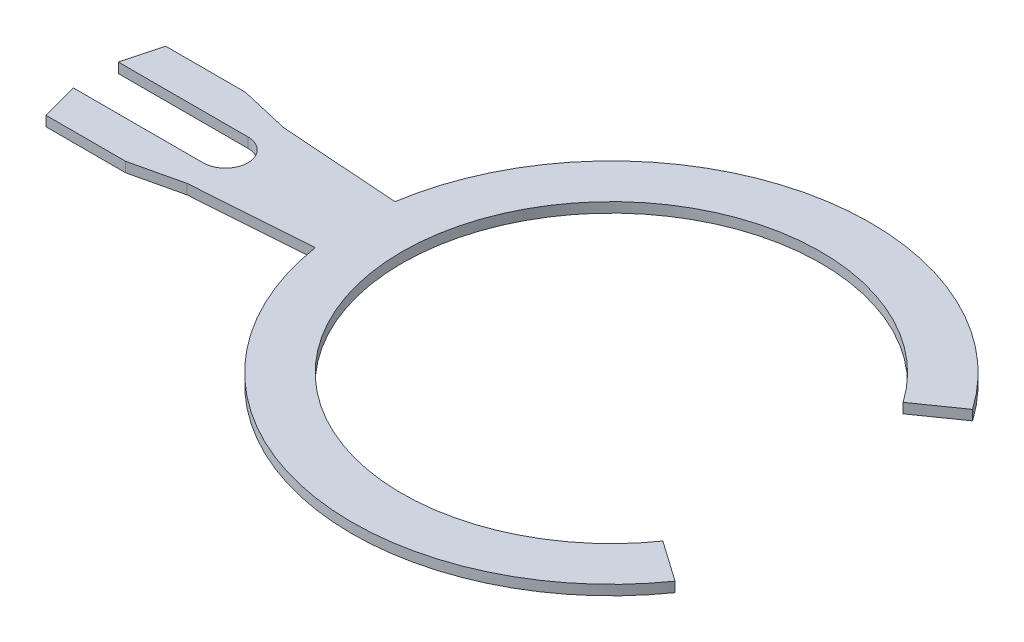
ISO-10303-21;
HEADER;
FILE_DESCRIPTION(('STEP AP214'),'2;1');
FILE_NAME('part.step','',(''),(''),'','','');
FILE_SCHEMA(('AUTOMOTIVE_DESIGN { 1 0 10303 214 1 1 1 1 }'));
ENDSEC;
DATA;
#1=APPLICATION_CONTEXT('core data for automotive mechanical design processes');
#2=APPLICATION_PROTOCOL_DEFINITION('international standard','automotive_design',2000,#1);
#3=PRODUCT_CONTEXT('',#1,'mechanical');
#4=PRODUCT('Part','Part','',(#3));
#5=PRODUCT_RELATED_PRODUCT_CATEGORY('part','',(#4));
#6=PRODUCT_DEFINITION_FORMATION('','',#4);
#7=PRODUCT_DEFINITION_CONTEXT('part definition',#1,'design');
#8=PRODUCT_DEFINITION('design','',#6,#7);
#9=PRODUCT_DEFINITION_SHAPE('','',#8);
#10=(LENGTH_UNIT() NAMED_UNIT(*) SI_UNIT(.MILLI.,.METRE.));
#11=(NAMED_UNIT(*) PLANE_ANGLE_UNIT() SI_UNIT($,.RADIAN.));
#12=(NAMED_UNIT(*) SI_UNIT($,.STERADIAN.) SOLID_ANGLE_UNIT());
#13=UNCERTAINTY_MEASURE_WITH_UNIT(LENGTH_MEASURE(1.E-05),#10,'distance_accuracy_value','');
#14=(GEOMETRIC_REPRESENTATION_CONTEXT(3) GLOBAL_UNCERTAINTY_ASSIGNED_CONTEXT((#13)) GLOBAL_UNIT_ASSIGNED_CONTEXT((#10,
#11,#12)) REPRESENTATION_CONTEXT('',''));
#15=CARTESIAN_POINT('',(0.,0.,0.));
#16=DIRECTION('',(0.,0.,1.));
#17=DIRECTION('',(1.,0.,0.));
#18=AXIS2_PLACEMENT_3D('',#15,#16,#17);
#19=CARTESIAN_POINT('',(0.,-0.1,0.));
#20=DIRECTION('',(0.,-1.,0.));
#21=DIRECTION('',(0.,0.,-1.));
#22=AXIS2_PLACEMENT_3D('',#19,#20,#21);
#23=CYLINDRICAL_SURFACE('',#22,2.1);
#24=CARTESIAN_POINT('',(0.,-0.2,0.));
#25=DIRECTION('',(0.,1.,0.));
#26=DIRECTION('',(0.,0.,1.));
#27=AXIS2_PLACEMENT_3D('',#24,#25,#26);
#28=CIRCLE('',#27,2.1);
#29=CARTESIAN_POINT('',(1.72021929300688,-0.2,-1.2045105163372));
#30=VERTEX_POINT('',#29);
#31=CARTESIAN_POINT('',(1.72021929300688,-0.2,1.2045105163372));
#32=VERTEX_POINT('',#31);
#33=EDGE_CURVE('E179',#30,#32,#28,.T.);
#34=ORIENTED_EDGE('',*,*,#33,.F.);
#35=DIRECTION('',(0.,-1.,0.));
#36=VECTOR('',#35,1.);
#37=CARTESIAN_POINT('',(1.72021929300688,-0.1,-1.2045105163372));
#38=LINE('',#37,#36);
#39=CARTESIAN_POINT('',(1.72021929300688,-0.1,-1.2045105163372));
#40=VERTEX_POINT('',#39);
#41=EDGE_CURVE('E11',#40,#30,#38,.T.);
#42=ORIENTED_EDGE('',*,*,#41,.F.);
#43=CARTESIAN_POINT('',(0.,-0.1,0.));
#44=DIRECTION('',(0.,1.,0.));
#45=DIRECTION('',(0.,0.,1.));
#46=AXIS2_PLACEMENT_3D('',#43,#44,#45);
#47=CIRCLE('',#46,2.1);
#48=CARTESIAN_POINT('',(1.72021929300688,-0.1,1.2045105163372));
#49=VERTEX_POINT('',#48);
#50=EDGE_CURVE('E223',#40,#49,#47,.T.);
#51=ORIENTED_EDGE('',*,*,#50,.T.);
#52=DIRECTION('',(0.,-1.,0.));
#53=VECTOR('',#52,1.);
#54=CARTESIAN_POINT('',(1.72021929300688,-0.1,1.2045105163372));
#55=LINE('',#54,#53);
#56=EDGE_CURVE('E37',#49,#32,#55,.T.);
#57=ORIENTED_EDGE('',*,*,#56,.T.);
#58=EDGE_LOOP('',(#34,#42,#51,#57));
#59=FACE_BOUND('',#58,.T.);
#60=ADVANCED_FACE('F34',(#59),#23,.F.);
#61=CARTESIAN_POINT('',(2.12979531515138,-0.1,-1.49129873451272));
#62=DIRECTION('',(0.573576436351048,0.,0.819152044288991));
#63=DIRECTION('',(0.819152044288991,0.,-0.573576436351048));
#64=AXIS2_PLACEMENT_3D('',#61,#62,#63);
#65=PLANE('',#64);
#66=DIRECTION('',(-0.819152044288991,0.,0.573576436351048));
#67=VECTOR('',#66,1.);
#68=CARTESIAN_POINT('',(2.12979531515138,-0.2,-1.49129873451272));
#69=LINE('',#68,#67);
#70=CARTESIAN_POINT('',(2.12979531515138,-0.2,-1.49129873451272));
#71=VERTEX_POINT('',#70);
#72=EDGE_CURVE('E221',#71,#30,#69,.T.);
#73=ORIENTED_EDGE('',*,*,#72,.F.);
#74=DIRECTION('',(0.,-1.,0.));
#75=VECTOR('',#74,1.);
#76=CARTESIAN_POINT('',(2.12979531515138,-0.1,-1.49129873451272));
#77=LINE('',#76,#75);
#78=CARTESIAN_POINT('',(2.12979531515138,-0.1,-1.49129873451272));
#79=VERTEX_POINT('',#78);
#80=EDGE_CURVE('E43',#79,#71,#77,.T.);
#81=ORIENTED_EDGE('',*,*,#80,.F.);
#82=DIRECTION('',(-0.819152044288991,0.,0.573576436351048));
#83=VECTOR('',#82,1.);
#84=CARTESIAN_POINT('',(2.12979531515138,-0.1,-1.49129873451272));
#85=LINE('',#84,#83);
#86=EDGE_CURVE('E169',#79,#40,#85,.T.);
#87=ORIENTED_EDGE('',*,*,#86,.T.);
#88=ORIENTED_EDGE('',*,*,#41,.T.);
#89=EDGE_LOOP('',(#73,#81,#87,#88));
#90=FACE_BOUND('',#89,.T.);
#91=ADVANCED_FACE('F251',(#90),#65,.T.);
#92=CARTESIAN_POINT('',(0.,-0.1,0.));
#93=DIRECTION('',(0.,-1.,0.));
#94=DIRECTION('',(0.,0.,-1.));
#95=AXIS2_PLACEMENT_3D('',#92,#93,#94);
#96=CYLINDRICAL_SURFACE('',#95,2.6);
#97=CARTESIAN_POINT('',(0.,-0.2,0.));
#98=DIRECTION('',(0.,-1.,0.));
#99=DIRECTION('',(0.,0.,-1.));
#100=AXIS2_PLACEMENT_3D('',#97,#98,#99);
#101=CIRCLE('',#100,2.6);
#102=CARTESIAN_POINT('',(-2.56904651573302,-0.2,-0.4));
#103=VERTEX_POINT('',#102);
#104=EDGE_CURVE('E156',#103,#71,#101,.T.);
#105=ORIENTED_EDGE('',*,*,#104,.F.);
#106=DIRECTION('',(0.,-1.,0.));
#107=VECTOR('',#106,1.);
#108=CARTESIAN_POINT('',(-2.56904651573302,-0.1,-0.4));
#109=LINE('',#108,#107);
#110=CARTESIAN_POINT('',(-2.56904651573302,-0.1,-0.4));
#111=VERTEX_POINT('',#110);
#112=EDGE_CURVE('E151',#111,#103,#109,.T.);
#113=ORIENTED_EDGE('',*,*,#112,.F.);
#114=CARTESIAN_POINT('',(0.,-0.1,0.));
#115=DIRECTION('',(0.,-1.,0.));
#116=DIRECTION('',(0.,0.,-1.));
#117=AXIS2_PLACEMENT_3D('',#114,#115,#116);
#118=CIRCLE('',#117,2.6);
#119=EDGE_CURVE('E154',#111,#79,#118,.T.);
#120=ORIENTED_EDGE('',*,*,#119,.T.);
#121=ORIENTED_EDGE('',*,*,#80,.T.);
#122=EDGE_LOOP('',(#105,#113,#120,#121));
#123=FACE_BOUND('',#122,.T.);
#124=ADVANCED_FACE('F153',(#123),#96,.T.);
#125=CARTESIAN_POINT('',(-3.76904651573302,-0.1,-0.483912174332216));
#126=DIRECTION('',(0.0697564737441285,0.,-0.997564050259824));
#127=DIRECTION('',(-0.997564050259824,0.,-0.0697564737441285));
#128=AXIS2_PLACEMENT_3D('',#125,#126,#127);
#129=PLANE('',#128);
#130=DIRECTION('',(0.997564050259824,0.,0.0697564737441285));
#131=VECTOR('',#130,1.);
#132=CARTESIAN_POINT('',(-3.76904651573302,-0.2,-0.483912174332216));
#133=LINE('',#132,#131);
#134=CARTESIAN_POINT('',(-3.76904651573302,-0.2,-0.483912174332216));
#135=VERTEX_POINT('',#134);
#136=EDGE_CURVE('E218',#135,#103,#133,.T.);
#137=ORIENTED_EDGE('',*,*,#136,.F.);
#138=DIRECTION('',(0.,-1.,0.));
#139=VECTOR('',#138,1.);
#140=CARTESIAN_POINT('',(-3.76904651573302,-0.1,-0.483912174332216));
#141=LINE('',#140,#139);
#142=CARTESIAN_POINT('',(-3.76904651573302,-0.1,-0.483912174332216));
#143=VERTEX_POINT('',#142);
#144=EDGE_CURVE('E161',#143,#135,#141,.T.);
#145=ORIENTED_EDGE('',*,*,#144,.F.);
#146=DIRECTION('',(0.997564050259824,0.,0.0697564737441285));
#147=VECTOR('',#146,1.);
#148=CARTESIAN_POINT('',(-3.76904651573302,-0.1,-0.483912174332216));
#149=LINE('',#148,#147);
#150=EDGE_CURVE('E167',#143,#111,#149,.T.);
#151=ORIENTED_EDGE('',*,*,#150,.T.);
#152=ORIENTED_EDGE('',*,*,#112,.T.);
#153=EDGE_LOOP('',(#137,#145,#151,#152));
#154=FACE_BOUND('',#153,.T.);
#155=ADVANCED_FACE('F171',(#154),#129,.T.);
#156=CARTESIAN_POINT('',(-4.26904651573302,-0.1,-0.599999999999999));
#157=DIRECTION('',(0.226160018119726,0.,-0.974090163282684));
#158=DIRECTION('',(-0.974090163282684,0.,-0.226160018119726));
#159=AXIS2_PLACEMENT_3D('',#156,#157,#158);
#160=PLANE('',#159);
#161=DIRECTION('',(0.974090163282684,0.,0.226160018119726));
#162=VECTOR('',#161,1.);
#163=CARTESIAN_POINT('',(-4.26904651573302,-0.2,-0.599999999999999));
#164=LINE('',#163,#162);
#165=CARTESIAN_POINT('',(-4.26904651573302,-0.2,-0.599999999999999));
#166=VERTEX_POINT('',#165);
#167=EDGE_CURVE('E215',#166,#135,#164,.T.);
#168=ORIENTED_EDGE('',*,*,#167,.F.);
#169=DIRECTION('',(0.,-1.,0.));
#170=VECTOR('',#169,1.);
#171=CARTESIAN_POINT('',(-4.26904651573302,-0.1,-0.599999999999999));
#172=LINE('',#171,#170);
#173=CARTESIAN_POINT('',(-4.26904651573302,-0.1,-0.599999999999999));
#174=VERTEX_POINT('',#173);
#175=EDGE_CURVE('E227',#174,#166,#172,.T.);
#176=ORIENTED_EDGE('',*,*,#175,.F.);
#177=DIRECTION('',(0.974090163282684,0.,0.226160018119726));
#178=VECTOR('',#177,1.);
#179=CARTESIAN_POINT('',(-4.26904651573302,-0.1,-0.599999999999999));
#180=LINE('',#179,#178);
#181=EDGE_CURVE('E172',#174,#143,#180,.T.);
#182=ORIENTED_EDGE('',*,*,#181,.T.);
#183=ORIENTED_EDGE('',*,*,#144,.T.);
#184=EDGE_LOOP('',(#168,#176,#182,#183));
#185=FACE_BOUND('',#184,.T.);
#186=ADVANCED_FACE('F264',(#185),#160,.T.);
#187=CARTESIAN_POINT('',(-5.06856556857135,-0.1,-0.599999999999999));
#188=DIRECTION('',(0.,0.,-1.));
#189=DIRECTION('',(-1.,0.,0.));
#190=AXIS2_PLACEMENT_3D('',#187,#188,#189);
#191=PLANE('',#190);
#192=DIRECTION('',(1.,0.,0.));
#193=VECTOR('',#192,1.);
#194=CARTESIAN_POINT('',(-5.06856556857135,-0.2,-0.599999999999999));
#195=LINE('',#194,#193);
#196=CARTESIAN_POINT('',(-5.06856556857135,-0.2,-0.599999999999999));
#197=VERTEX_POINT('',#196);
#198=EDGE_CURVE('E212',#197,#166,#195,.T.);
#199=ORIENTED_EDGE('',*,*,#198,.F.);
#200=DIRECTION('',(0.,-1.,0.));
#201=VECTOR('',#200,1.);
#202=CARTESIAN_POINT('',(-5.06856556857135,-0.1,-0.599999999999999));
#203=LINE('',#202,#201);
#204=CARTESIAN_POINT('',(-5.06856556857135,-0.1,-0.599999999999999));
#205=VERTEX_POINT('',#204);
#206=EDGE_CURVE('E229',#205,#197,#203,.T.);
#207=ORIENTED_EDGE('',*,*,#206,.F.);
#208=DIRECTION('',(1.,0.,0.));
#209=VECTOR('',#208,1.);
#210=CARTESIAN_POINT('',(-5.06856556857135,-0.1,-0.599999999999999));
#211=LINE('',#210,#209);
#212=EDGE_CURVE('E174',#205,#174,#211,.T.);
#213=ORIENTED_EDGE('',*,*,#212,.T.);
#214=ORIENTED_EDGE('',*,*,#175,.T.);
#215=EDGE_LOOP('',(#199,#207,#213,#214));
#216=FACE_BOUND('',#215,.T.);
#217=ADVANCED_FACE('F267',(#216),#191,.T.);
#218=CARTESIAN_POINT('',(-5.16904651573302,-0.1,-0.224999999999999));
#219=DIRECTION('',(-0.965925826289067,0.,-0.258819045102525));
#220=DIRECTION('',(-0.258819045102525,0.,0.965925826289067));
#221=AXIS2_PLACEMENT_3D('',#218,#219,#220);
#222=PLANE('',#221);
#223=DIRECTION('',(0.258819045102525,0.,-0.965925826289067));
#224=VECTOR('',#223,1.);
#225=CARTESIAN_POINT('',(-5.16904651573302,-0.2,-0.224999999999999));
#226=LINE('',#225,#224);
#227=CARTESIAN_POINT('',(-5.16904651573302,-0.2,-0.224999999999999));
#228=VERTEX_POINT('',#227);
#229=EDGE_CURVE('E209',#228,#197,#226,.T.);
#230=ORIENTED_EDGE('',*,*,#229,.F.);
#231=DIRECTION('',(0.,-1.,0.));
#232=VECTOR('',#231,1.);
#233=CARTESIAN_POINT('',(-5.16904651573302,-0.1,-0.224999999999999));
#234=LINE('',#233,#232);
#235=CARTESIAN_POINT('',(-5.16904651573302,-0.1,-0.224999999999999));
#236=VERTEX_POINT('',#235);
#237=EDGE_CURVE('E231',#236,#228,#234,.T.);
#238=ORIENTED_EDGE('',*,*,#237,.F.);
#239=DIRECTION('',(0.258819045102525,0.,-0.965925826289067));
#240=VECTOR('',#239,1.);
#241=CARTESIAN_POINT('',(-5.16904651573302,-0.1,-0.224999999999999));
#242=LINE('',#241,#240);
#243=EDGE_CURVE('E448',#236,#205,#242,.T.);
#244=ORIENTED_EDGE('',*,*,#243,.T.);
#245=ORIENTED_EDGE('',*,*,#206,.T.);
#246=EDGE_LOOP('',(#230,#238,#244,#245));
#247=FACE_BOUND('',#246,.T.);
#248=ADVANCED_FACE('F271',(#247),#222,.T.);
#249=CARTESIAN_POINT('',(-3.86904651573303,-0.1,-0.224999999999999));
#250=DIRECTION('',(0.,0.,1.));
#251=DIRECTION('',(1.,0.,0.));
#252=AXIS2_PLACEMENT_3D('',#249,#250,#251);
#253=PLANE('',#252);
#254=DIRECTION('',(-1.,0.,0.));
#255=VECTOR('',#254,1.);
#256=CARTESIAN_POINT('',(-3.86904651573303,-0.2,-0.224999999999999));
#257=LINE('',#256,#255);
#258=CARTESIAN_POINT('',(-3.86904651573303,-0.2,-0.224999999999999));
#259=VERTEX_POINT('',#258);
#260=EDGE_CURVE('E206',#259,#228,#257,.T.);
#261=ORIENTED_EDGE('',*,*,#260,.F.);
#262=DIRECTION('',(0.,-1.,0.));
#263=VECTOR('',#262,1.);
#264=CARTESIAN_POINT('',(-3.86904651573303,-0.1,-0.224999999999999));
#265=LINE('',#264,#263);
#266=CARTESIAN_POINT('',(-3.86904651573303,-0.1,-0.224999999999999));
#267=VERTEX_POINT('',#266);
#268=EDGE_CURVE('E233',#267,#259,#265,.T.);
#269=ORIENTED_EDGE('',*,*,#268,.F.);
#270=DIRECTION('',(-1.,0.,0.));
#271=VECTOR('',#270,1.);
#272=CARTESIAN_POINT('',(-3.86904651573303,-0.1,-0.224999999999999));
#273=LINE('',#272,#271);
#274=EDGE_CURVE('E444',#267,#236,#273,.T.);
#275=ORIENTED_EDGE('',*,*,#274,.T.);
#276=ORIENTED_EDGE('',*,*,#237,.T.);
#277=EDGE_LOOP('',(#261,#269,#275,#276));
#278=FACE_BOUND('',#277,.T.);
#279=ADVANCED_FACE('F275',(#278),#253,.T.);
#280=CARTESIAN_POINT('',(-3.86904651573303,-0.1,0.));
#281=DIRECTION('',(0.,-1.,0.));
#282=DIRECTION('',(0.,0.,-1.));
#283=AXIS2_PLACEMENT_3D('',#280,#281,#282);
#284=CYLINDRICAL_SURFACE('',#283,0.225);
#285=CARTESIAN_POINT('',(-3.86904651573303,-0.2,0.));
#286=DIRECTION('',(0.,1.,0.));
#287=DIRECTION('',(0.,0.,1.));
#288=AXIS2_PLACEMENT_3D('',#285,#286,#287);
#289=CIRCLE('',#288,0.225);
#290=CARTESIAN_POINT('',(-3.86904651573303,-0.2,0.225));
#291=VERTEX_POINT('',#290);
#292=EDGE_CURVE('E203',#291,#259,#289,.T.);
#293=ORIENTED_EDGE('',*,*,#292,.F.);
#294=DIRECTION('',(0.,-1.,0.));
#295=VECTOR('',#294,1.);
#296=CARTESIAN_POINT('',(-3.86904651573303,-0.1,0.225));
#297=LINE('',#296,#295);
#298=CARTESIAN_POINT('',(-3.86904651573303,-0.1,0.225));
#299=VERTEX_POINT('',#298);
#300=EDGE_CURVE('E235',#299,#291,#297,.T.);
#301=ORIENTED_EDGE('',*,*,#300,.F.);
#302=CARTESIAN_POINT('',(-3.86904651573303,-0.1,0.));
#303=DIRECTION('',(0.,1.,0.));
#304=DIRECTION('',(0.,0.,1.));
#305=AXIS2_PLACEMENT_3D('',#302,#303,#304);
#306=CIRCLE('',#305,0.225);
#307=EDGE_CURVE('E455',#299,#267,#306,.T.);
#308=ORIENTED_EDGE('',*,*,#307,.T.);
#309=ORIENTED_EDGE('',*,*,#268,.T.);
#310=EDGE_LOOP('',(#293,#301,#308,#309));
#311=FACE_BOUND('',#310,.T.);
#312=ADVANCED_FACE('F279',(#311),#284,.F.);
#313=CARTESIAN_POINT('',(-5.16904651573302,-0.1,0.225000000000001));
#314=DIRECTION('',(0.,0.,-1.));
#315=DIRECTION('',(-1.,0.,0.));
#316=AXIS2_PLACEMENT_3D('',#313,#314,#315);
#317=PLANE('',#316);
#318=DIRECTION('',(1.,0.,0.));
#319=VECTOR('',#318,1.);
#320=CARTESIAN_POINT('',(-5.16904651573302,-0.2,0.225000000000001));
#321=LINE('',#320,#319);
#322=CARTESIAN_POINT('',(-5.16904651573302,-0.2,0.225000000000001));
#323=VERTEX_POINT('',#322);
#324=EDGE_CURVE('E200',#323,#291,#321,.T.);
#325=ORIENTED_EDGE('',*,*,#324,.F.);
#326=DIRECTION('',(0.,-1.,0.));
#327=VECTOR('',#326,1.);
#328=CARTESIAN_POINT('',(-5.16904651573302,-0.1,0.225000000000001));
#329=LINE('',#328,#327);
#330=CARTESIAN_POINT('',(-5.16904651573302,-0.1,0.225000000000001));
#331=VERTEX_POINT('',#330);
#332=EDGE_CURVE('E237',#331,#323,#329,.T.);
#333=ORIENTED_EDGE('',*,*,#332,.F.);
#334=DIRECTION('',(1.,0.,0.));
#335=VECTOR('',#334,1.);
#336=CARTESIAN_POINT('',(-5.16904651573302,-0.1,0.225000000000001));
#337=LINE('',#336,#335);
#338=EDGE_CURVE('E437',#331,#299,#337,.T.);
#339=ORIENTED_EDGE('',*,*,#338,.T.);
#340=ORIENTED_EDGE('',*,*,#300,.T.);
#341=EDGE_LOOP('',(#325,#333,#339,#340));
#342=FACE_BOUND('',#341,.T.);
#343=ADVANCED_FACE('F283',(#342),#317,.T.);
#344=CARTESIAN_POINT('',(-5.06856556857135,-0.1,0.600000000000001));
#345=DIRECTION('',(-0.965925826289067,0.,0.258819045102525));
#346=DIRECTION('',(0.258819045102525,0.,0.965925826289067));
#347=AXIS2_PLACEMENT_3D('',#344,#345,#346);
#348=PLANE('',#347);
#349=DIRECTION('',(-0.258819045102525,0.,-0.965925826289067));
#350=VECTOR('',#349,1.);
#351=CARTESIAN_POINT('',(-5.06856556857135,-0.2,0.600000000000001));
#352=LINE('',#351,#350);
#353=CARTESIAN_POINT('',(-5.06856556857135,-0.2,0.600000000000001));
#354=VERTEX_POINT('',#353);
#355=EDGE_CURVE('E197',#354,#323,#352,.T.);
#356=ORIENTED_EDGE('',*,*,#355,.F.);
#357=DIRECTION('',(0.,-1.,0.));
#358=VECTOR('',#357,1.);
#359=CARTESIAN_POINT('',(-5.06856556857135,-0.1,0.600000000000001));
#360=LINE('',#359,#358);
#361=CARTESIAN_POINT('',(-5.06856556857135,-0.1,0.600000000000001));
#362=VERTEX_POINT('',#361);
#363=EDGE_CURVE('E239',#362,#354,#360,.T.);
#364=ORIENTED_EDGE('',*,*,#363,.F.);
#365=DIRECTION('',(-0.258819045102525,0.,-0.965925826289067));
#366=VECTOR('',#365,1.);
#367=CARTESIAN_POINT('',(-5.06856556857135,-0.1,0.600000000000001));
#368=LINE('',#367,#366);
#369=EDGE_CURVE('E433',#362,#331,#368,.T.);
#370=ORIENTED_EDGE('',*,*,#369,.T.);
#371=ORIENTED_EDGE('',*,*,#332,.T.);
#372=EDGE_LOOP('',(#356,#364,#370,#371));
#373=FACE_BOUND('',#372,.T.);
#374=ADVANCED_FACE('F287',(#373),#348,.T.);
#375=CARTESIAN_POINT('',(-4.26904651573302,-0.1,0.600000000000001));
#376=DIRECTION('',(0.,0.,1.));
#377=DIRECTION('',(1.,0.,0.));
#378=AXIS2_PLACEMENT_3D('',#375,#376,#377);
#379=PLANE('',#378);
#380=DIRECTION('',(-1.,0.,0.));
#381=VECTOR('',#380,1.);
#382=CARTESIAN_POINT('',(-4.26904651573302,-0.2,0.600000000000001));
#383=LINE('',#382,#381);
#384=CARTESIAN_POINT('',(-4.26904651573302,-0.2,0.600000000000001));
#385=VERTEX_POINT('',#384);
#386=EDGE_CURVE('E194',#385,#354,#383,.T.);
#387=ORIENTED_EDGE('',*,*,#386,.F.);
#388=DIRECTION('',(0.,-1.,0.));
#389=VECTOR('',#388,1.);
#390=CARTESIAN_POINT('',(-4.26904651573302,-0.1,0.600000000000001));
#391=LINE('',#390,#389);
#392=CARTESIAN_POINT('',(-4.26904651573302,-0.1,0.600000000000001));
#393=VERTEX_POINT('',#392);
#394=EDGE_CURVE('E241',#393,#385,#391,.T.);
#395=ORIENTED_EDGE('',*,*,#394,.F.);
#396=DIRECTION('',(-1.,0.,0.));
#397=VECTOR('',#396,1.);
#398=CARTESIAN_POINT('',(-4.26904651573302,-0.1,0.600000000000001));
#399=LINE('',#398,#397);
#400=EDGE_CURVE('E459',#393,#362,#399,.T.);
#401=ORIENTED_EDGE('',*,*,#400,.T.);
#402=ORIENTED_EDGE('',*,*,#363,.T.);
#403=EDGE_LOOP('',(#387,#395,#401,#402));
#404=FACE_BOUND('',#403,.T.);
#405=ADVANCED_FACE('F291',(#404),#379,.T.);
#406=CARTESIAN_POINT('',(-3.76904651573302,-0.1,0.483912174332217));
#407=DIRECTION('',(0.226160018119726,0.,0.974090163282683));
#408=DIRECTION('',(0.974090163282684,0.,-0.226160018119727));
#409=AXIS2_PLACEMENT_3D('',#406,#407,#408);
#410=PLANE('',#409);
#411=DIRECTION('',(-0.974090163282683,0.,0.226160018119726));
#412=VECTOR('',#411,1.);
#413=CARTESIAN_POINT('',(-3.76904651573302,-0.2,0.483912174332217));
#414=LINE('',#413,#412);
#415=CARTESIAN_POINT('',(-3.76904651573302,-0.2,0.483912174332217));
#416=VERTEX_POINT('',#415);
#417=EDGE_CURVE('E191',#416,#385,#414,.T.);
#418=ORIENTED_EDGE('',*,*,#417,.F.);
#419=DIRECTION('',(0.,-1.,0.));
#420=VECTOR('',#419,1.);
#421=CARTESIAN_POINT('',(-3.76904651573302,-0.1,0.483912174332217));
#422=LINE('',#421,#420);
#423=CARTESIAN_POINT('',(-3.76904651573302,-0.1,0.483912174332217));
#424=VERTEX_POINT('',#423);
#425=EDGE_CURVE('E243',#424,#416,#422,.T.);
#426=ORIENTED_EDGE('',*,*,#425,.F.);
#427=DIRECTION('',(-0.974090163282683,0.,0.226160018119726));
#428=VECTOR('',#427,1.);
#429=CARTESIAN_POINT('',(-3.76904651573302,-0.1,0.483912174332217));
#430=LINE('',#429,#428);
#431=EDGE_CURVE('E426',#424,#393,#430,.T.);
#432=ORIENTED_EDGE('',*,*,#431,.T.);
#433=ORIENTED_EDGE('',*,*,#394,.T.);
#434=EDGE_LOOP('',(#418,#426,#432,#433));
#435=FACE_BOUND('',#434,.T.);
#436=ADVANCED_FACE('F295',(#435),#410,.T.);
#437=CARTESIAN_POINT('',(-2.56904651573302,-0.1,0.400000000000012));
#438=DIRECTION('',(0.0697564737441189,0.,0.997564050259825));
#439=DIRECTION('',(0.997564050259825,0.,-0.0697564737441189));
#440=AXIS2_PLACEMENT_3D('',#437,#438,#439);
#441=PLANE('',#440);
#442=DIRECTION('',(-0.997564050259825,0.,0.0697564737441189));
#443=VECTOR('',#442,1.);
#444=CARTESIAN_POINT('',(-2.56904651573302,-0.2,0.400000000000012));
#445=LINE('',#444,#443);
#446=CARTESIAN_POINT('',(-2.56904651573302,-0.2,0.400000000000014));
#447=VERTEX_POINT('',#446);
#448=EDGE_CURVE('E188',#447,#416,#445,.T.);
#449=ORIENTED_EDGE('',*,*,#448,.F.);
#450=DIRECTION('',(0.,-1.,0.));
#451=VECTOR('',#450,1.);
#452=CARTESIAN_POINT('',(-2.56904651573302,-0.1,0.400000000000014));
#453=LINE('',#452,#451);
#454=CARTESIAN_POINT('',(-2.56904651573302,-0.1,0.400000000000014));
#455=VERTEX_POINT('',#454);
#456=EDGE_CURVE('E245',#455,#447,#453,.T.);
#457=ORIENTED_EDGE('',*,*,#456,.F.);
#458=DIRECTION('',(-0.997564050259825,0.,0.0697564737441189));
#459=VECTOR('',#458,1.);
#460=CARTESIAN_POINT('',(-2.56904651573302,-0.1,0.400000000000012));
#461=LINE('',#460,#459);
#462=EDGE_CURVE('E422',#455,#424,#461,.T.);
#463=ORIENTED_EDGE('',*,*,#462,.T.);
#464=ORIENTED_EDGE('',*,*,#425,.T.);
#465=EDGE_LOOP('',(#449,#457,#463,#464));
#466=FACE_BOUND('',#465,.T.);
#467=ADVANCED_FACE('F299',(#466),#441,.T.);
#468=CARTESIAN_POINT('',(0.,-0.1,0.));
#469=DIRECTION('',(0.,-1.,0.));
#470=DIRECTION('',(0.,0.,-1.));
#471=AXIS2_PLACEMENT_3D('',#468,#469,#470);
#472=CYLINDRICAL_SURFACE('',#471,2.6);
#473=CARTESIAN_POINT('',(0.,-0.2,0.));
#474=DIRECTION('',(0.,-1.,0.));
#475=DIRECTION('',(0.,0.,-1.));
#476=AXIS2_PLACEMENT_3D('',#473,#474,#475);
#477=CIRCLE('',#476,2.6);
#478=CARTESIAN_POINT('',(2.12979531515138,-0.2,1.49129873451272));
#479=VERTEX_POINT('',#478);
#480=EDGE_CURVE('E185',#479,#447,#477,.T.);
#481=ORIENTED_EDGE('',*,*,#480,.F.);
#482=DIRECTION('',(0.,-1.,0.));
#483=VECTOR('',#482,1.);
#484=CARTESIAN_POINT('',(2.12979531515138,-0.1,1.49129873451272));
#485=LINE('',#484,#483);
#486=CARTESIAN_POINT('',(2.12979531515138,-0.1,1.49129873451272));
#487=VERTEX_POINT('',#486);
#488=EDGE_CURVE('E246',#487,#479,#485,.T.);
#489=ORIENTED_EDGE('',*,*,#488,.F.);
#490=CARTESIAN_POINT('',(0.,-0.1,0.));
#491=DIRECTION('',(0.,-1.,0.));
#492=DIRECTION('',(0.,0.,-1.));
#493=AXIS2_PLACEMENT_3D('',#490,#491,#492);
#494=CIRCLE('',#493,2.6);
#495=EDGE_CURVE('E463',#487,#455,#494,.T.);
#496=ORIENTED_EDGE('',*,*,#495,.T.);
#497=ORIENTED_EDGE('',*,*,#456,.T.);
#498=EDGE_LOOP('',(#481,#489,#496,#497));
#499=FACE_BOUND('',#498,.T.);
#500=ADVANCED_FACE('F303',(#499),#472,.T.);
#501=CARTESIAN_POINT('',(1.72021929300688,-0.1,1.2045105163372));
#502=DIRECTION('',(0.573576436351047,0.,-0.819152044288991));
#503=DIRECTION('',(-0.819152044288991,0.,-0.573576436351047));
#504=AXIS2_PLACEMENT_3D('',#501,#502,#503);
#505=PLANE('',#504);
#506=DIRECTION('',(0.819152044288991,0.,0.573576436351047));
#507=VECTOR('',#506,1.);
#508=CARTESIAN_POINT('',(1.72021929300688,-0.2,1.2045105163372));
#509=LINE('',#508,#507);
#510=EDGE_CURVE('E182',#32,#479,#509,.T.);
#511=ORIENTED_EDGE('',*,*,#510,.F.);
#512=ORIENTED_EDGE('',*,*,#56,.F.);
#513=DIRECTION('',(0.819152044288991,0.,0.573576436351047));
#514=VECTOR('',#513,1.);
#515=CARTESIAN_POINT('',(1.72021929300688,-0.1,1.2045105163372));
#516=LINE('',#515,#514);
#517=EDGE_CURVE('E465',#49,#487,#516,.T.);
#518=ORIENTED_EDGE('',*,*,#517,.T.);
#519=ORIENTED_EDGE('',*,*,#488,.T.);
#520=EDGE_LOOP('',(#511,#512,#518,#519));
#521=FACE_BOUND('',#520,.T.);
#522=ADVANCED_FACE('F248',(#521),#505,.T.);
#523=CARTESIAN_POINT('',(0.,-0.1,0.));
#524=DIRECTION('',(0.,1.,0.));
#525=DIRECTION('',(0.,0.,1.));
#526=AXIS2_PLACEMENT_3D('',#523,#524,#525);
#527=PLANE('',#526);
#528=ORIENTED_EDGE('',*,*,#50,.F.);
#529=ORIENTED_EDGE('',*,*,#86,.F.);
#530=ORIENTED_EDGE('',*,*,#119,.F.);
#531=ORIENTED_EDGE('',*,*,#150,.F.);
#532=ORIENTED_EDGE('',*,*,#181,.F.);
#533=ORIENTED_EDGE('',*,*,#212,.F.);
#534=ORIENTED_EDGE('',*,*,#243,.F.);
#535=ORIENTED_EDGE('',*,*,#274,.F.);
#536=ORIENTED_EDGE('',*,*,#307,.F.);
#537=ORIENTED_EDGE('',*,*,#338,.F.);
#538=ORIENTED_EDGE('',*,*,#369,.F.);
#539=ORIENTED_EDGE('',*,*,#400,.F.);
#540=ORIENTED_EDGE('',*,*,#431,.F.);
#541=ORIENTED_EDGE('',*,*,#462,.F.);
#542=ORIENTED_EDGE('',*,*,#495,.F.);
#543=ORIENTED_EDGE('',*,*,#517,.F.);
#544=EDGE_LOOP('',(#528,#529,#530,#531,#532,#533,#534,#535,#536,#537,#538,#539,#540,#541,#542,#543));
#545=FACE_BOUND('',#544,.T.);
#546=ADVANCED_FACE('F165',(#545),#527,.T.);
#547=CARTESIAN_POINT('',(0.,-0.2,0.));
#548=DIRECTION('',(0.,1.,0.));
#549=DIRECTION('',(0.,0.,1.));
#550=AXIS2_PLACEMENT_3D('',#547,#548,#549);
#551=PLANE('',#550);
#552=ORIENTED_EDGE('',*,*,#33,.T.);
#553=ORIENTED_EDGE('',*,*,#510,.T.);
#554=ORIENTED_EDGE('',*,*,#480,.T.);
#555=ORIENTED_EDGE('',*,*,#448,.T.);
#556=ORIENTED_EDGE('',*,*,#417,.T.);
#557=ORIENTED_EDGE('',*,*,#386,.T.);
#558=ORIENTED_EDGE('',*,*,#355,.T.);
#559=ORIENTED_EDGE('',*,*,#324,.T.);
#560=ORIENTED_EDGE('',*,*,#292,.T.);
#561=ORIENTED_EDGE('',*,*,#260,.T.);
#562=ORIENTED_EDGE('',*,*,#229,.T.);
#563=ORIENTED_EDGE('',*,*,#198,.T.);
#564=ORIENTED_EDGE('',*,*,#167,.T.);
#565=ORIENTED_EDGE('',*,*,#136,.T.);
#566=ORIENTED_EDGE('',*,*,#104,.T.);
#567=ORIENTED_EDGE('',*,*,#72,.T.);
#568=EDGE_LOOP('',(#552,#553,#554,#555,#556,#557,#558,#559,#560,#561,#562,#563,#564,#565,#566,#567));
#569=FACE_BOUND('',#568,.T.);
#570=ADVANCED_FACE('F250',(#569),#551,.F.);
#571=CLOSED_SHELL('',(#60,#91,#124,#155,#186,#217,#248,#279,#312,#343,#374,#405,#436,#467,#500,
#522,#546,#570));
#572=MANIFOLD_SOLID_BREP('B2',#571);
#573=ADVANCED_BREP_SHAPE_REPRESENTATION('',(#18,#572),#14);
#574=SHAPE_DEFINITION_REPRESENTATION(#9,#573);
ENDSEC;
END-ISO-10303-21;
